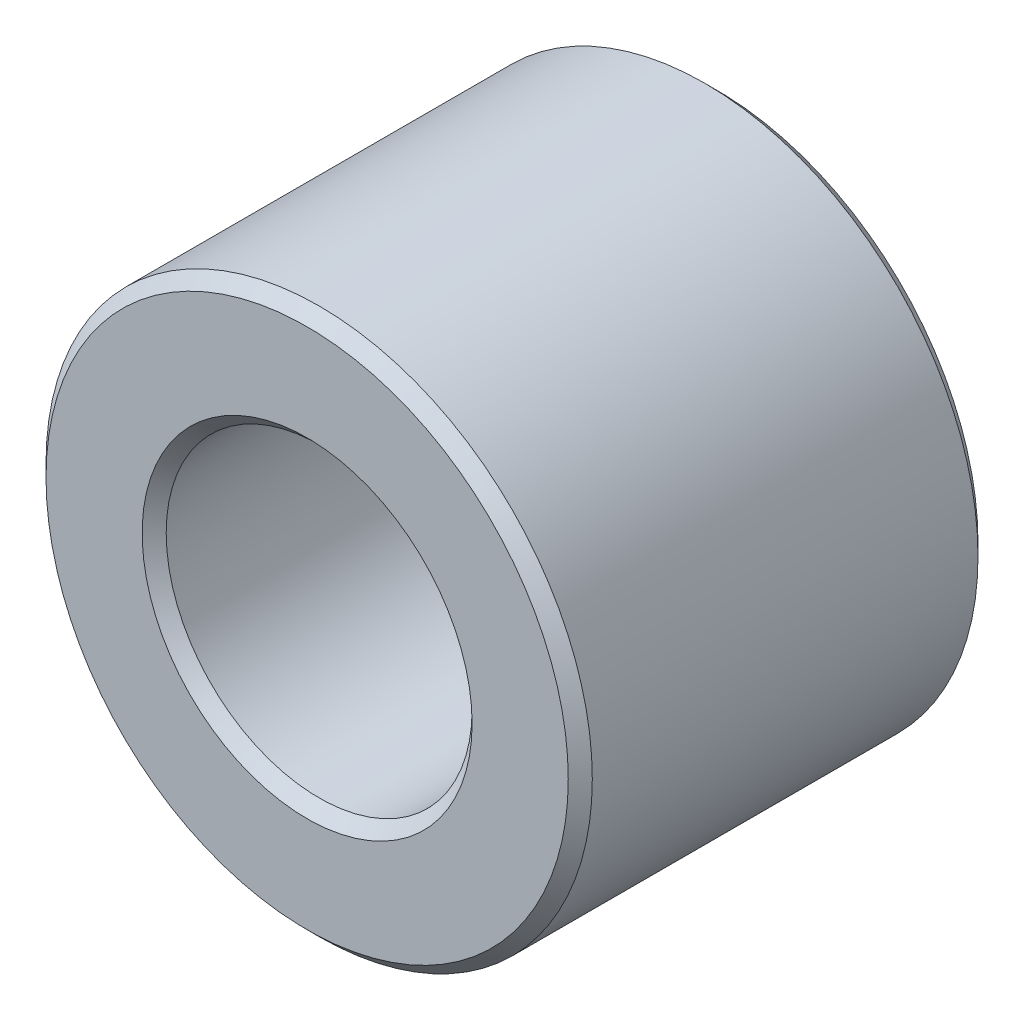
ISO-10303-21;
HEADER;
FILE_DESCRIPTION(('STEP AP214'),'2;1');
FILE_NAME('part.step','',(''),(''),'','','');
FILE_SCHEMA(('AUTOMOTIVE_DESIGN { 1 0 10303 214 1 1 1 1 }'));
ENDSEC;
DATA;
#1=APPLICATION_CONTEXT('core data for automotive mechanical design processes');
#2=APPLICATION_PROTOCOL_DEFINITION('international standard','automotive_design',2000,#1);
#3=PRODUCT_CONTEXT('',#1,'mechanical');
#4=PRODUCT('Part','Part','',(#3));
#5=PRODUCT_RELATED_PRODUCT_CATEGORY('part','',(#4));
#6=PRODUCT_DEFINITION_FORMATION('','',#4);
#7=PRODUCT_DEFINITION_CONTEXT('part definition',#1,'design');
#8=PRODUCT_DEFINITION('design','',#6,#7);
#9=PRODUCT_DEFINITION_SHAPE('','',#8);
#10=(LENGTH_UNIT() NAMED_UNIT(*) SI_UNIT(.MILLI.,.METRE.));
#11=(NAMED_UNIT(*) PLANE_ANGLE_UNIT() SI_UNIT($,.RADIAN.));
#12=(NAMED_UNIT(*) SI_UNIT($,.STERADIAN.) SOLID_ANGLE_UNIT());
#13=UNCERTAINTY_MEASURE_WITH_UNIT(LENGTH_MEASURE(1.E-05),#10,'distance_accuracy_value','');
#14=(GEOMETRIC_REPRESENTATION_CONTEXT(3) GLOBAL_UNCERTAINTY_ASSIGNED_CONTEXT((#13)) GLOBAL_UNIT_ASSIGNED_CONTEXT((#10,
#11,#12)) REPRESENTATION_CONTEXT('',''));
#15=CARTESIAN_POINT('',(0.,0.,0.));
#16=DIRECTION('',(0.,0.,1.));
#17=DIRECTION('',(1.,0.,0.));
#18=AXIS2_PLACEMENT_3D('',#15,#16,#17);
#19=CARTESIAN_POINT('',(0.,0.,-2.38125));
#20=DIRECTION('',(0.,0.,1.));
#21=DIRECTION('',(1.,0.,0.));
#22=AXIS2_PLACEMENT_3D('',#19,#20,#21);
#23=CYLINDRICAL_SURFACE('',#22,3.175);
#24=CARTESIAN_POINT('',(0.,0.,2.24155));
#25=DIRECTION('',(0.,0.,1.));
#26=DIRECTION('',(1.,0.,0.));
#27=AXIS2_PLACEMENT_3D('',#24,#25,#26);
#28=CIRCLE('',#27,3.175);
#29=CARTESIAN_POINT('',(3.175,0.,2.24155));
#30=VERTEX_POINT('',#29);
#31=EDGE_CURVE('E65',#30,#30,#28,.F.);
#32=ORIENTED_EDGE('',*,*,#31,.T.);
#33=EDGE_LOOP('',(#32));
#34=FACE_BOUND('',#33,.T.);
#35=CARTESIAN_POINT('',(0.,0.,-2.24155));
#36=DIRECTION('',(0.,0.,1.));
#37=DIRECTION('',(1.,0.,0.));
#38=AXIS2_PLACEMENT_3D('',#35,#36,#37);
#39=CIRCLE('',#38,3.175);
#40=CARTESIAN_POINT('',(3.175,0.,-2.24155));
#41=VERTEX_POINT('',#40);
#42=EDGE_CURVE('E69',#41,#41,#39,.T.);
#43=ORIENTED_EDGE('',*,*,#42,.T.);
#44=EDGE_LOOP('',(#43));
#45=FACE_BOUND('',#44,.T.);
#46=ADVANCED_FACE('F39',(#34,#45),#23,.T.);
#47=CARTESIAN_POINT('',(0.,0.,-2.38125));
#48=DIRECTION('',(0.,0.,1.));
#49=DIRECTION('',(1.,0.,0.));
#50=AXIS2_PLACEMENT_3D('',#47,#48,#49);
#51=PLANE('',#50);
#52=CARTESIAN_POINT('',(0.,0.,-2.38125));
#53=DIRECTION('',(0.,0.,1.));
#54=DIRECTION('',(1.,0.,0.));
#55=AXIS2_PLACEMENT_3D('',#52,#53,#54);
#56=CIRCLE('',#55,3.0353);
#57=CARTESIAN_POINT('',(3.0353,0.,-2.38125));
#58=VERTEX_POINT('',#57);
#59=EDGE_CURVE('E53',#58,#58,#56,.F.);
#60=ORIENTED_EDGE('',*,*,#59,.T.);
#61=EDGE_LOOP('',(#60));
#62=FACE_BOUND('',#61,.T.);
#63=CARTESIAN_POINT('',(0.,0.,-2.38125));
#64=DIRECTION('',(0.,0.,1.));
#65=DIRECTION('',(1.,0.,0.));
#66=AXIS2_PLACEMENT_3D('',#63,#64,#65);
#67=CIRCLE('',#66,1.9177);
#68=CARTESIAN_POINT('',(1.9177,0.,-2.38125));
#69=VERTEX_POINT('',#68);
#70=EDGE_CURVE('E59',#69,#69,#67,.T.);
#71=ORIENTED_EDGE('',*,*,#70,.T.);
#72=EDGE_LOOP('',(#71));
#73=FACE_BOUND('',#72,.T.);
#74=ADVANCED_FACE('F98',(#62,#73),#51,.F.);
#75=CARTESIAN_POINT('',(0.,0.,-2.38125));
#76=DIRECTION('',(0.,0.,1.));
#77=DIRECTION('',(1.,0.,0.));
#78=AXIS2_PLACEMENT_3D('',#75,#76,#77);
#79=CYLINDRICAL_SURFACE('',#78,1.778);
#80=CARTESIAN_POINT('',(0.,0.,2.24155));
#81=DIRECTION('',(0.,0.,1.));
#82=DIRECTION('',(1.,0.,0.));
#83=AXIS2_PLACEMENT_3D('',#80,#81,#82);
#84=CIRCLE('',#83,1.778);
#85=CARTESIAN_POINT('',(1.778,0.,2.24155));
#86=VERTEX_POINT('',#85);
#87=EDGE_CURVE('E10',#86,#86,#84,.T.);
#88=ORIENTED_EDGE('',*,*,#87,.T.);
#89=EDGE_LOOP('',(#88));
#90=FACE_BOUND('',#89,.T.);
#91=CARTESIAN_POINT('',(0.,0.,-2.24155));
#92=DIRECTION('',(0.,0.,1.));
#93=DIRECTION('',(1.,0.,0.));
#94=AXIS2_PLACEMENT_3D('',#91,#92,#93);
#95=CIRCLE('',#94,1.778);
#96=CARTESIAN_POINT('',(1.778,0.,-2.24155));
#97=VERTEX_POINT('',#96);
#98=EDGE_CURVE('E47',#97,#97,#95,.F.);
#99=ORIENTED_EDGE('',*,*,#98,.T.);
#100=EDGE_LOOP('',(#99));
#101=FACE_BOUND('',#100,.T.);
#102=ADVANCED_FACE('F104',(#90,#101),#79,.F.);
#103=CARTESIAN_POINT('',(0.,0.,2.38125));
#104=DIRECTION('',(0.,0.,1.));
#105=DIRECTION('',(1.,0.,0.));
#106=AXIS2_PLACEMENT_3D('',#103,#104,#105);
#107=PLANE('',#106);
#108=CARTESIAN_POINT('',(0.,0.,2.38125));
#109=DIRECTION('',(0.,0.,1.));
#110=DIRECTION('',(1.,0.,0.));
#111=AXIS2_PLACEMENT_3D('',#108,#109,#110);
#112=CIRCLE('',#111,3.0353);
#113=CARTESIAN_POINT('',(3.0353,0.,2.38125));
#114=VERTEX_POINT('',#113);
#115=EDGE_CURVE('E73',#114,#114,#112,.T.);
#116=ORIENTED_EDGE('',*,*,#115,.T.);
#117=EDGE_LOOP('',(#116));
#118=FACE_BOUND('',#117,.T.);
#119=CARTESIAN_POINT('',(0.,0.,2.38125));
#120=DIRECTION('',(0.,0.,1.));
#121=DIRECTION('',(1.,0.,0.));
#122=AXIS2_PLACEMENT_3D('',#119,#120,#121);
#123=CIRCLE('',#122,1.9177);
#124=CARTESIAN_POINT('',(1.9177,0.,2.38125));
#125=VERTEX_POINT('',#124);
#126=EDGE_CURVE('E77',#125,#125,#123,.F.);
#127=ORIENTED_EDGE('',*,*,#126,.T.);
#128=EDGE_LOOP('',(#127));
#129=FACE_BOUND('',#128,.T.);
#130=ADVANCED_FACE('F83',(#118,#129),#107,.T.);
#131=CARTESIAN_POINT('',(0.,0.,2.38125));
#132=DIRECTION('',(0.,0.,-1.));
#133=DIRECTION('',(-1.,0.,0.));
#134=AXIS2_PLACEMENT_3D('',#131,#132,#133);
#135=CONICAL_SURFACE('',#134,3.0353,0.785398163397445);
#136=ORIENTED_EDGE('',*,*,#31,.F.);
#137=EDGE_LOOP('',(#136));
#138=FACE_BOUND('',#137,.T.);
#139=ORIENTED_EDGE('',*,*,#115,.F.);
#140=EDGE_LOOP('',(#139));
#141=FACE_BOUND('',#140,.T.);
#142=ADVANCED_FACE('F94',(#138,#141),#135,.T.);
#143=CARTESIAN_POINT('',(0.,0.,-2.24155));
#144=DIRECTION('',(0.,0.,1.));
#145=DIRECTION('',(1.,0.,0.));
#146=AXIS2_PLACEMENT_3D('',#143,#144,#145);
#147=CONICAL_SURFACE('',#146,3.175,0.785398163397453);
#148=ORIENTED_EDGE('',*,*,#59,.F.);
#149=EDGE_LOOP('',(#148));
#150=FACE_BOUND('',#149,.T.);
#151=ORIENTED_EDGE('',*,*,#42,.F.);
#152=EDGE_LOOP('',(#151));
#153=FACE_BOUND('',#152,.T.);
#154=ADVANCED_FACE('F88',(#150,#153),#147,.T.);
#155=CARTESIAN_POINT('',(0.,0.,2.24155));
#156=DIRECTION('',(0.,0.,1.));
#157=DIRECTION('',(1.,0.,0.));
#158=AXIS2_PLACEMENT_3D('',#155,#156,#157);
#159=CONICAL_SURFACE('',#158,1.778,0.785398163397451);
#160=ORIENTED_EDGE('',*,*,#126,.F.);
#161=EDGE_LOOP('',(#160));
#162=FACE_BOUND('',#161,.T.);
#163=ORIENTED_EDGE('',*,*,#87,.F.);
#164=EDGE_LOOP('',(#163));
#165=FACE_BOUND('',#164,.T.);
#166=ADVANCED_FACE('F85',(#162,#165),#159,.F.);
#167=CARTESIAN_POINT('',(0.,0.,-2.38125));
#168=DIRECTION('',(0.,0.,-1.));
#169=DIRECTION('',(-1.,0.,0.));
#170=AXIS2_PLACEMENT_3D('',#167,#168,#169);
#171=CONICAL_SURFACE('',#170,1.9177,0.785398163397448);
#172=ORIENTED_EDGE('',*,*,#98,.F.);
#173=EDGE_LOOP('',(#172));
#174=FACE_BOUND('',#173,.T.);
#175=ORIENTED_EDGE('',*,*,#70,.F.);
#176=EDGE_LOOP('',(#175));
#177=FACE_BOUND('',#176,.T.);
#178=ADVANCED_FACE('F41',(#174,#177),#171,.F.);
#179=CLOSED_SHELL('',(#46,#74,#102,#130,#142,#154,#166,#178));
#180=MANIFOLD_SOLID_BREP('B2',#179);
#181=ADVANCED_BREP_SHAPE_REPRESENTATION('',(#18,#180),#14);
#182=SHAPE_DEFINITION_REPRESENTATION(#9,#181);
ENDSEC;
END-ISO-10303-21;
